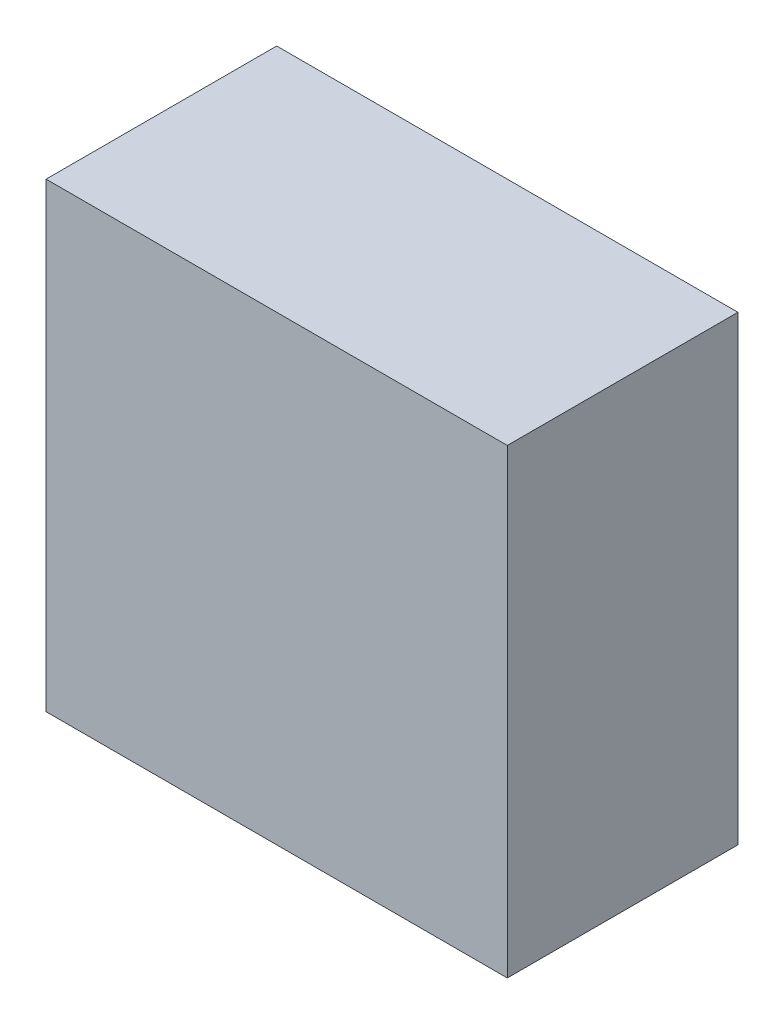
ISO-10303-21;
HEADER;
FILE_DESCRIPTION(('STEP AP214'),'2;1');
FILE_NAME('part.step','',(''),(''),'','','');
FILE_SCHEMA(('AUTOMOTIVE_DESIGN { 1 0 10303 214 1 1 1 1 }'));
ENDSEC;
DATA;
#1=APPLICATION_CONTEXT('core data for automotive mechanical design processes');
#2=APPLICATION_PROTOCOL_DEFINITION('international standard','automotive_design',2000,#1);
#3=PRODUCT_CONTEXT('',#1,'mechanical');
#4=PRODUCT('Part','Part','',(#3));
#5=PRODUCT_RELATED_PRODUCT_CATEGORY('part','',(#4));
#6=PRODUCT_DEFINITION_FORMATION('','',#4);
#7=PRODUCT_DEFINITION_CONTEXT('part definition',#1,'design');
#8=PRODUCT_DEFINITION('design','',#6,#7);
#9=PRODUCT_DEFINITION_SHAPE('','',#8);
#10=(LENGTH_UNIT() NAMED_UNIT(*) SI_UNIT(.MILLI.,.METRE.));
#11=(NAMED_UNIT(*) PLANE_ANGLE_UNIT() SI_UNIT($,.RADIAN.));
#12=(NAMED_UNIT(*) SI_UNIT($,.STERADIAN.) SOLID_ANGLE_UNIT());
#13=UNCERTAINTY_MEASURE_WITH_UNIT(LENGTH_MEASURE(1.E-05),#10,'distance_accuracy_value','');
#14=(GEOMETRIC_REPRESENTATION_CONTEXT(3) GLOBAL_UNCERTAINTY_ASSIGNED_CONTEXT((#13)) GLOBAL_UNIT_ASSIGNED_CONTEXT((#10,
#11,#12)) REPRESENTATION_CONTEXT('',''));
#15=CARTESIAN_POINT('',(0.,0.,0.));
#16=DIRECTION('',(0.,0.,1.));
#17=DIRECTION('',(1.,0.,0.));
#18=AXIS2_PLACEMENT_3D('',#15,#16,#17);
#19=CARTESIAN_POINT('',(0.,0.,2.75));
#20=DIRECTION('',(0.,0.,-1.));
#21=DIRECTION('',(-1.,0.,0.));
#22=AXIS2_PLACEMENT_3D('',#19,#20,#21);
#23=PLANE('',#22);
#24=DIRECTION('',(1.,0.,0.));
#25=VECTOR('',#24,1.);
#26=CARTESIAN_POINT('',(-18.,165.941489418563,2.75));
#27=LINE('',#26,#25);
#28=CARTESIAN_POINT('',(-22.,165.941489418563,2.75));
#29=VERTEX_POINT('',#28);
#30=CARTESIAN_POINT('',(-18.,165.941489418563,2.75));
#31=VERTEX_POINT('',#30);
#32=EDGE_CURVE('E80',#29,#31,#27,.T.);
#33=ORIENTED_EDGE('',*,*,#32,.T.);
#34=DIRECTION('',(0.,1.,0.));
#35=VECTOR('',#34,1.);
#36=CARTESIAN_POINT('',(-18.,169.941489418563,2.75));
#37=LINE('',#36,#35);
#38=CARTESIAN_POINT('',(-18.,169.941489418563,2.75));
#39=VERTEX_POINT('',#38);
#40=EDGE_CURVE('E55',#31,#39,#37,.T.);
#41=ORIENTED_EDGE('',*,*,#40,.T.);
#42=DIRECTION('',(1.,0.,0.));
#43=VECTOR('',#42,1.);
#44=CARTESIAN_POINT('',(-18.,169.941489418563,2.75));
#45=LINE('',#44,#43);
#46=CARTESIAN_POINT('',(-22.,169.941489418563,2.75));
#47=VERTEX_POINT('',#46);
#48=EDGE_CURVE('E57',#39,#47,#45,.F.);
#49=ORIENTED_EDGE('',*,*,#48,.T.);
#50=DIRECTION('',(0.,1.,0.));
#51=VECTOR('',#50,1.);
#52=CARTESIAN_POINT('',(-22.,169.941489418563,2.75));
#53=LINE('',#52,#51);
#54=EDGE_CURVE('E20',#47,#29,#53,.F.);
#55=ORIENTED_EDGE('',*,*,#54,.T.);
#56=EDGE_LOOP('',(#33,#41,#49,#55));
#57=FACE_BOUND('',#56,.T.);
#58=ADVANCED_FACE('F17',(#57),#23,.F.);
#59=CARTESIAN_POINT('',(-22.,169.941489418563,2.75));
#60=DIRECTION('',(1.,0.,0.));
#61=DIRECTION('',(0.,0.,-1.));
#62=AXIS2_PLACEMENT_3D('',#59,#60,#61);
#63=PLANE('',#62);
#64=DIRECTION('',(0.,0.,1.));
#65=VECTOR('',#64,1.);
#66=CARTESIAN_POINT('',(-22.,165.941489418563,2.75));
#67=LINE('',#66,#65);
#68=CARTESIAN_POINT('',(-22.,165.941489418563,0.75));
#69=VERTEX_POINT('',#68);
#70=EDGE_CURVE('E68',#69,#29,#67,.T.);
#71=ORIENTED_EDGE('',*,*,#70,.T.);
#72=ORIENTED_EDGE('',*,*,#54,.F.);
#73=DIRECTION('',(0.,0.,-1.));
#74=VECTOR('',#73,1.);
#75=CARTESIAN_POINT('',(-22.,169.941489418563,2.75));
#76=LINE('',#75,#74);
#77=CARTESIAN_POINT('',(-22.,169.941489418563,0.75));
#78=VERTEX_POINT('',#77);
#79=EDGE_CURVE('E63',#47,#78,#76,.T.);
#80=ORIENTED_EDGE('',*,*,#79,.T.);
#81=DIRECTION('',(0.,1.,0.));
#82=VECTOR('',#81,1.);
#83=CARTESIAN_POINT('',(-22.,0.,0.75));
#84=LINE('',#83,#82);
#85=EDGE_CURVE('E83',#69,#78,#84,.T.);
#86=ORIENTED_EDGE('',*,*,#85,.F.);
#87=EDGE_LOOP('',(#71,#72,#80,#86));
#88=FACE_BOUND('',#87,.T.);
#89=ADVANCED_FACE('F65',(#88),#63,.F.);
#90=CARTESIAN_POINT('',(-18.,169.941489418563,2.75));
#91=DIRECTION('',(0.,-1.,0.));
#92=DIRECTION('',(0.,0.,-1.));
#93=AXIS2_PLACEMENT_3D('',#90,#91,#92);
#94=PLANE('',#93);
#95=ORIENTED_EDGE('',*,*,#79,.F.);
#96=ORIENTED_EDGE('',*,*,#48,.F.);
#97=DIRECTION('',(0.,0.,1.));
#98=VECTOR('',#97,1.);
#99=CARTESIAN_POINT('',(-18.,169.941489418563,2.75));
#100=LINE('',#99,#98);
#101=CARTESIAN_POINT('',(-18.,169.941489418563,0.75));
#102=VERTEX_POINT('',#101);
#103=EDGE_CURVE('E75',#39,#102,#100,.F.);
#104=ORIENTED_EDGE('',*,*,#103,.T.);
#105=DIRECTION('',(-1.,0.,0.));
#106=VECTOR('',#105,1.);
#107=CARTESIAN_POINT('',(0.,169.941489418563,0.75));
#108=LINE('',#107,#106);
#109=EDGE_CURVE('E72',#78,#102,#108,.F.);
#110=ORIENTED_EDGE('',*,*,#109,.F.);
#111=EDGE_LOOP('',(#95,#96,#104,#110));
#112=FACE_BOUND('',#111,.T.);
#113=ADVANCED_FACE('F70',(#112),#94,.F.);
#114=CARTESIAN_POINT('',(-18.,169.941489418563,2.75));
#115=DIRECTION('',(-1.,0.,0.));
#116=DIRECTION('',(0.,0.,1.));
#117=AXIS2_PLACEMENT_3D('',#114,#115,#116);
#118=PLANE('',#117);
#119=ORIENTED_EDGE('',*,*,#103,.F.);
#120=ORIENTED_EDGE('',*,*,#40,.F.);
#121=DIRECTION('',(0.,0.,1.));
#122=VECTOR('',#121,1.);
#123=CARTESIAN_POINT('',(-18.,165.941489418563,2.75));
#124=LINE('',#123,#122);
#125=CARTESIAN_POINT('',(-18.,165.941489418563,0.75));
#126=VERTEX_POINT('',#125);
#127=EDGE_CURVE('E35',#31,#126,#124,.F.);
#128=ORIENTED_EDGE('',*,*,#127,.T.);
#129=DIRECTION('',(0.,1.,0.));
#130=VECTOR('',#129,1.);
#131=CARTESIAN_POINT('',(-18.,0.,0.75));
#132=LINE('',#131,#130);
#133=EDGE_CURVE('E26',#102,#126,#132,.F.);
#134=ORIENTED_EDGE('',*,*,#133,.F.);
#135=EDGE_LOOP('',(#119,#120,#128,#134));
#136=FACE_BOUND('',#135,.T.);
#137=ADVANCED_FACE('F89',(#136),#118,.F.);
#138=CARTESIAN_POINT('',(-18.,165.941489418563,2.75));
#139=DIRECTION('',(0.,1.,0.));
#140=DIRECTION('',(0.,0.,1.));
#141=AXIS2_PLACEMENT_3D('',#138,#139,#140);
#142=PLANE('',#141);
#143=ORIENTED_EDGE('',*,*,#127,.F.);
#144=ORIENTED_EDGE('',*,*,#32,.F.);
#145=ORIENTED_EDGE('',*,*,#70,.F.);
#146=DIRECTION('',(-1.,0.,0.));
#147=VECTOR('',#146,1.);
#148=CARTESIAN_POINT('',(0.,165.941489418563,0.75));
#149=LINE('',#148,#147);
#150=EDGE_CURVE('E11',#126,#69,#149,.T.);
#151=ORIENTED_EDGE('',*,*,#150,.F.);
#152=EDGE_LOOP('',(#143,#144,#145,#151));
#153=FACE_BOUND('',#152,.T.);
#154=ADVANCED_FACE('F91',(#153),#142,.F.);
#155=CARTESIAN_POINT('',(0.,0.,0.75));
#156=DIRECTION('',(0.,0.,-1.));
#157=DIRECTION('',(-1.,0.,0.));
#158=AXIS2_PLACEMENT_3D('',#155,#156,#157);
#159=PLANE('',#158);
#160=ORIENTED_EDGE('',*,*,#133,.T.);
#161=ORIENTED_EDGE('',*,*,#150,.T.);
#162=ORIENTED_EDGE('',*,*,#85,.T.);
#163=ORIENTED_EDGE('',*,*,#109,.T.);
#164=EDGE_LOOP('',(#160,#161,#162,#163));
#165=FACE_BOUND('',#164,.T.);
#166=ADVANCED_FACE('F88',(#165),#159,.T.);
#167=CLOSED_SHELL('',(#58,#89,#113,#137,#154,#166));
#168=MANIFOLD_SOLID_BREP('B1',#167);
#169=ADVANCED_BREP_SHAPE_REPRESENTATION('',(#18,#168),#14);
#170=SHAPE_DEFINITION_REPRESENTATION(#9,#169);
ENDSEC;
END-ISO-10303-21;
